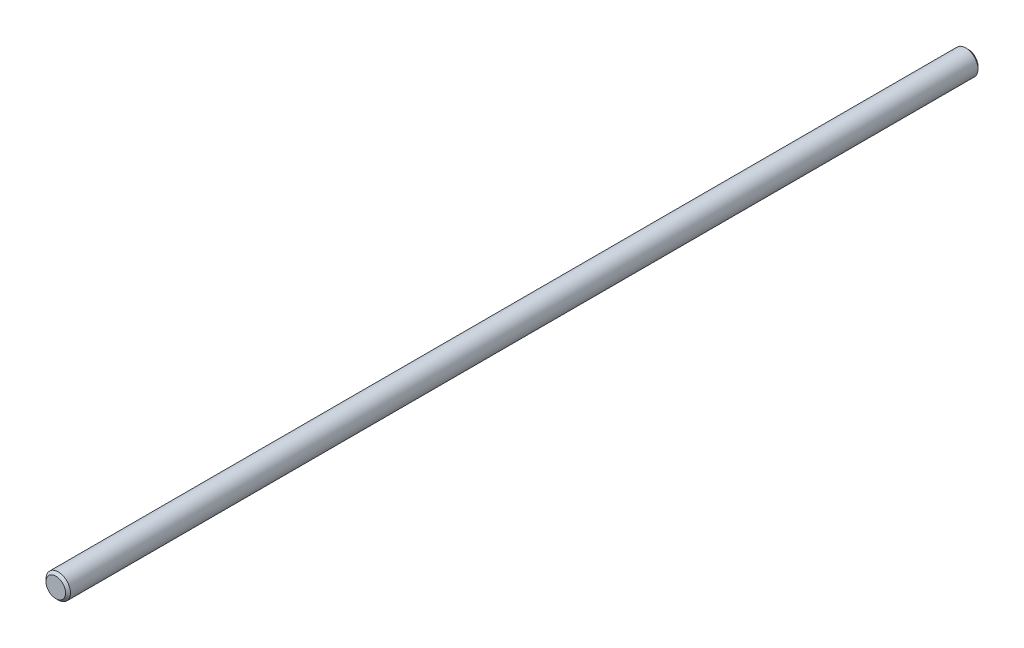
ISO-10303-21;
HEADER;
FILE_DESCRIPTION(('STEP AP214'),'2;1');
FILE_NAME('part.step','',(''),(''),'','','');
FILE_SCHEMA(('AUTOMOTIVE_DESIGN { 1 0 10303 214 1 1 1 1 }'));
ENDSEC;
DATA;
#1=APPLICATION_CONTEXT('core data for automotive mechanical design processes');
#2=APPLICATION_PROTOCOL_DEFINITION('international standard','automotive_design',2000,#1);
#3=PRODUCT_CONTEXT('',#1,'mechanical');
#4=PRODUCT('Part','Part','',(#3));
#5=PRODUCT_RELATED_PRODUCT_CATEGORY('part','',(#4));
#6=PRODUCT_DEFINITION_FORMATION('','',#4);
#7=PRODUCT_DEFINITION_CONTEXT('part definition',#1,'design');
#8=PRODUCT_DEFINITION('design','',#6,#7);
#9=PRODUCT_DEFINITION_SHAPE('','',#8);
#10=(LENGTH_UNIT() NAMED_UNIT(*) SI_UNIT(.MILLI.,.METRE.));
#11=(NAMED_UNIT(*) PLANE_ANGLE_UNIT() SI_UNIT($,.RADIAN.));
#12=(NAMED_UNIT(*) SI_UNIT($,.STERADIAN.) SOLID_ANGLE_UNIT());
#13=UNCERTAINTY_MEASURE_WITH_UNIT(LENGTH_MEASURE(1.E-05),#10,'distance_accuracy_value','');
#14=(GEOMETRIC_REPRESENTATION_CONTEXT(3) GLOBAL_UNCERTAINTY_ASSIGNED_CONTEXT((#13)) GLOBAL_UNIT_ASSIGNED_CONTEXT((#10,
#11,#12)) REPRESENTATION_CONTEXT('',''));
#15=CARTESIAN_POINT('',(0.,0.,0.));
#16=DIRECTION('',(0.,0.,1.));
#17=DIRECTION('',(1.,0.,0.));
#18=AXIS2_PLACEMENT_3D('',#15,#16,#17);
#19=CARTESIAN_POINT('',(0.,0.,177.8));
#20=DIRECTION('',(0.,0.,-1.));
#21=DIRECTION('',(-1.,0.,0.));
#22=AXIS2_PLACEMENT_3D('',#19,#20,#21);
#23=CYLINDRICAL_SURFACE('',#22,4.7625);
#24=CARTESIAN_POINT('',(0.,0.,-176.8475));
#25=DIRECTION('',(0.,0.,1.));
#26=DIRECTION('',(1.,0.,0.));
#27=AXIS2_PLACEMENT_3D('',#24,#25,#26);
#28=CIRCLE('',#27,4.7625);
#29=CARTESIAN_POINT('',(4.7625,0.,-176.8475));
#30=VERTEX_POINT('',#29);
#31=EDGE_CURVE('E50',#30,#30,#28,.T.);
#32=ORIENTED_EDGE('',*,*,#31,.T.);
#33=EDGE_LOOP('',(#32));
#34=FACE_BOUND('',#33,.T.);
#35=CARTESIAN_POINT('',(0.,0.,176.8475));
#36=DIRECTION('',(0.,0.,1.));
#37=DIRECTION('',(1.,0.,0.));
#38=AXIS2_PLACEMENT_3D('',#35,#36,#37);
#39=CIRCLE('',#38,4.7625);
#40=CARTESIAN_POINT('',(4.7625,0.,176.8475));
#41=VERTEX_POINT('',#40);
#42=EDGE_CURVE('E55',#41,#41,#39,.F.);
#43=ORIENTED_EDGE('',*,*,#42,.T.);
#44=EDGE_LOOP('',(#43));
#45=FACE_BOUND('',#44,.T.);
#46=ADVANCED_FACE('F37',(#34,#45),#23,.T.);
#47=CARTESIAN_POINT('',(0.,0.,177.8));
#48=DIRECTION('',(0.,0.,1.));
#49=DIRECTION('',(1.,0.,0.));
#50=AXIS2_PLACEMENT_3D('',#47,#48,#49);
#51=PLANE('',#50);
#52=CARTESIAN_POINT('',(0.,0.,177.8));
#53=DIRECTION('',(0.,0.,1.));
#54=DIRECTION('',(1.,0.,0.));
#55=AXIS2_PLACEMENT_3D('',#52,#53,#54);
#56=CIRCLE('',#55,3.80999999999998);
#57=CARTESIAN_POINT('',(3.80999999999998,0.,177.8));
#58=VERTEX_POINT('',#57);
#59=EDGE_CURVE('E10',#58,#58,#56,.T.);
#60=ORIENTED_EDGE('',*,*,#59,.T.);
#61=EDGE_LOOP('',(#60));
#62=FACE_BOUND('',#61,.T.);
#63=ADVANCED_FACE('F72',(#62),#51,.T.);
#64=CARTESIAN_POINT('',(0.,0.,-177.8));
#65=DIRECTION('',(0.,0.,1.));
#66=DIRECTION('',(1.,0.,0.));
#67=AXIS2_PLACEMENT_3D('',#64,#65,#66);
#68=PLANE('',#67);
#69=CARTESIAN_POINT('',(0.,0.,-177.8));
#70=DIRECTION('',(0.,0.,1.));
#71=DIRECTION('',(1.,0.,0.));
#72=AXIS2_PLACEMENT_3D('',#69,#70,#71);
#73=CIRCLE('',#72,3.81000000000004);
#74=CARTESIAN_POINT('',(3.81000000000004,0.,-177.8));
#75=VERTEX_POINT('',#74);
#76=EDGE_CURVE('E45',#75,#75,#73,.F.);
#77=ORIENTED_EDGE('',*,*,#76,.T.);
#78=EDGE_LOOP('',(#77));
#79=FACE_BOUND('',#78,.T.);
#80=ADVANCED_FACE('F69',(#79),#68,.F.);
#81=CARTESIAN_POINT('',(0.,0.,-176.8475));
#82=DIRECTION('',(0.,0.,1.));
#83=DIRECTION('',(1.,0.,0.));
#84=AXIS2_PLACEMENT_3D('',#81,#82,#83);
#85=CONICAL_SURFACE('',#84,4.7625,0.785398163397447);
#86=ORIENTED_EDGE('',*,*,#76,.F.);
#87=EDGE_LOOP('',(#86));
#88=FACE_BOUND('',#87,.T.);
#89=ORIENTED_EDGE('',*,*,#31,.F.);
#90=EDGE_LOOP('',(#89));
#91=FACE_BOUND('',#90,.T.);
#92=ADVANCED_FACE('F65',(#88,#91),#85,.T.);
#93=CARTESIAN_POINT('',(0.,0.,177.8));
#94=DIRECTION('',(0.,0.,-1.));
#95=DIRECTION('',(-1.,0.,0.));
#96=AXIS2_PLACEMENT_3D('',#93,#94,#95);
#97=CONICAL_SURFACE('',#96,3.80999999999998,0.785398163397461);
#98=ORIENTED_EDGE('',*,*,#42,.F.);
#99=EDGE_LOOP('',(#98));
#100=FACE_BOUND('',#99,.T.);
#101=ORIENTED_EDGE('',*,*,#59,.F.);
#102=EDGE_LOOP('',(#101));
#103=FACE_BOUND('',#102,.T.);
#104=ADVANCED_FACE('F39',(#100,#103),#97,.T.);
#105=CLOSED_SHELL('',(#46,#63,#80,#92,#104));
#106=MANIFOLD_SOLID_BREP('B2',#105);
#107=ADVANCED_BREP_SHAPE_REPRESENTATION('',(#18,#106),#14);
#108=SHAPE_DEFINITION_REPRESENTATION(#9,#107);
ENDSEC;
END-ISO-10303-21;
